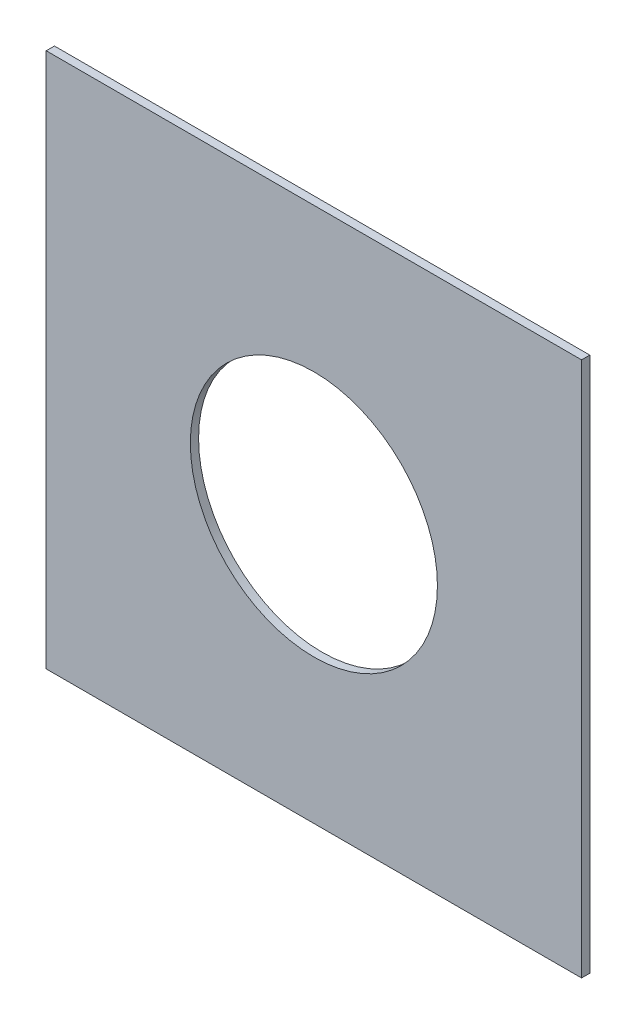
ISO-10303-21;
HEADER;
FILE_DESCRIPTION(('STEP AP214'),'2;1');
FILE_NAME('part.step','',(''),(''),'','','');
FILE_SCHEMA(('AUTOMOTIVE_DESIGN { 1 0 10303 214 1 1 1 1 }'));
ENDSEC;
DATA;
#1=APPLICATION_CONTEXT('core data for automotive mechanical design processes');
#2=APPLICATION_PROTOCOL_DEFINITION('international standard','automotive_design',2000,#1);
#3=PRODUCT_CONTEXT('',#1,'mechanical');
#4=PRODUCT('Part','Part','',(#3));
#5=PRODUCT_RELATED_PRODUCT_CATEGORY('part','',(#4));
#6=PRODUCT_DEFINITION_FORMATION('','',#4);
#7=PRODUCT_DEFINITION_CONTEXT('part definition',#1,'design');
#8=PRODUCT_DEFINITION('design','',#6,#7);
#9=PRODUCT_DEFINITION_SHAPE('','',#8);
#10=(LENGTH_UNIT() NAMED_UNIT(*) SI_UNIT(.MILLI.,.METRE.));
#11=(NAMED_UNIT(*) PLANE_ANGLE_UNIT() SI_UNIT($,.RADIAN.));
#12=(NAMED_UNIT(*) SI_UNIT($,.STERADIAN.) SOLID_ANGLE_UNIT());
#13=UNCERTAINTY_MEASURE_WITH_UNIT(LENGTH_MEASURE(1.E-05),#10,'distance_accuracy_value','');
#14=(GEOMETRIC_REPRESENTATION_CONTEXT(3) GLOBAL_UNCERTAINTY_ASSIGNED_CONTEXT((#13)) GLOBAL_UNIT_ASSIGNED_CONTEXT((#10,
#11,#12)) REPRESENTATION_CONTEXT('',''));
#15=CARTESIAN_POINT('',(0.,0.,0.));
#16=DIRECTION('',(0.,0.,1.));
#17=DIRECTION('',(1.,0.,0.));
#18=AXIS2_PLACEMENT_3D('',#15,#16,#17);
#19=CARTESIAN_POINT('',(0.575,3.549,-6.999));
#20=DIRECTION('',(-1.,0.,0.));
#21=DIRECTION('',(0.,1.,0.));
#22=AXIS2_PLACEMENT_3D('',#19,#20,#21);
#23=PLANE('',#22);
#24=DIRECTION('',(0.,0.,1.));
#25=VECTOR('',#24,1.);
#26=CARTESIAN_POINT('',(0.575,4.85,-7.01));
#27=LINE('',#26,#25);
#28=CARTESIAN_POINT('',(0.575,4.85,-7.02));
#29=VERTEX_POINT('',#28);
#30=CARTESIAN_POINT('',(0.575,4.85,-7.));
#31=VERTEX_POINT('',#30);
#32=EDGE_CURVE('E55',#29,#31,#27,.T.);
#33=ORIENTED_EDGE('',*,*,#32,.F.);
#34=DIRECTION('',(0.,1.,0.));
#35=VECTOR('',#34,1.);
#36=CARTESIAN_POINT('',(0.575,4.2,-7.02));
#37=LINE('',#36,#35);
#38=CARTESIAN_POINT('',(0.575,3.55,-7.02));
#39=VERTEX_POINT('',#38);
#40=EDGE_CURVE('E93',#39,#29,#37,.T.);
#41=ORIENTED_EDGE('',*,*,#40,.F.);
#42=DIRECTION('',(0.,0.,1.));
#43=VECTOR('',#42,1.);
#44=CARTESIAN_POINT('',(0.575,3.55,-7.01));
#45=LINE('',#44,#43);
#46=CARTESIAN_POINT('',(0.575,3.55,-7.));
#47=VERTEX_POINT('',#46);
#48=EDGE_CURVE('E35',#39,#47,#45,.T.);
#49=ORIENTED_EDGE('',*,*,#48,.T.);
#50=DIRECTION('',(0.,-1.,0.));
#51=VECTOR('',#50,1.);
#52=CARTESIAN_POINT('',(0.575,4.2,-7.));
#53=LINE('',#52,#51);
#54=EDGE_CURVE('E76',#31,#47,#53,.T.);
#55=ORIENTED_EDGE('',*,*,#54,.F.);
#56=EDGE_LOOP('',(#33,#41,#49,#55));
#57=FACE_BOUND('',#56,.T.);
#58=ADVANCED_FACE('F17',(#57),#23,.T.);
#59=CARTESIAN_POINT('',(0.574,4.85,-6.999));
#60=DIRECTION('',(0.,1.,0.));
#61=DIRECTION('',(1.,0.,0.));
#62=AXIS2_PLACEMENT_3D('',#59,#60,#61);
#63=PLANE('',#62);
#64=DIRECTION('',(0.,0.,1.));
#65=VECTOR('',#64,1.);
#66=CARTESIAN_POINT('',(1.875,4.85,-7.01));
#67=LINE('',#66,#65);
#68=CARTESIAN_POINT('',(1.875,4.85,-7.02));
#69=VERTEX_POINT('',#68);
#70=CARTESIAN_POINT('',(1.875,4.85,-7.));
#71=VERTEX_POINT('',#70);
#72=EDGE_CURVE('E61',#69,#71,#67,.T.);
#73=ORIENTED_EDGE('',*,*,#72,.F.);
#74=DIRECTION('',(1.,0.,0.));
#75=VECTOR('',#74,1.);
#76=CARTESIAN_POINT('',(1.225,4.85,-7.02));
#77=LINE('',#76,#75);
#78=EDGE_CURVE('E89',#29,#69,#77,.T.);
#79=ORIENTED_EDGE('',*,*,#78,.F.);
#80=ORIENTED_EDGE('',*,*,#32,.T.);
#81=DIRECTION('',(-1.,0.,0.));
#82=VECTOR('',#81,1.);
#83=CARTESIAN_POINT('',(1.225,4.85,-7.));
#84=LINE('',#83,#82);
#85=EDGE_CURVE('E72',#71,#31,#84,.T.);
#86=ORIENTED_EDGE('',*,*,#85,.F.);
#87=EDGE_LOOP('',(#73,#79,#80,#86));
#88=FACE_BOUND('',#87,.T.);
#89=ADVANCED_FACE('F73',(#88),#63,.T.);
#90=CARTESIAN_POINT('',(1.875,4.851,-6.999));
#91=DIRECTION('',(1.,0.,0.));
#92=DIRECTION('',(0.,-1.,0.));
#93=AXIS2_PLACEMENT_3D('',#90,#91,#92);
#94=PLANE('',#93);
#95=DIRECTION('',(0.,0.,-1.));
#96=VECTOR('',#95,1.);
#97=CARTESIAN_POINT('',(1.875,3.55,-7.01));
#98=LINE('',#97,#96);
#99=CARTESIAN_POINT('',(1.875,3.55,-7.));
#100=VERTEX_POINT('',#99);
#101=CARTESIAN_POINT('',(1.875,3.55,-7.02));
#102=VERTEX_POINT('',#101);
#103=EDGE_CURVE('E69',#100,#102,#98,.T.);
#104=ORIENTED_EDGE('',*,*,#103,.T.);
#105=DIRECTION('',(0.,-1.,0.));
#106=VECTOR('',#105,1.);
#107=CARTESIAN_POINT('',(1.875,4.2,-7.02));
#108=LINE('',#107,#106);
#109=EDGE_CURVE('E67',#69,#102,#108,.T.);
#110=ORIENTED_EDGE('',*,*,#109,.F.);
#111=ORIENTED_EDGE('',*,*,#72,.T.);
#112=DIRECTION('',(0.,1.,0.));
#113=VECTOR('',#112,1.);
#114=CARTESIAN_POINT('',(1.875,4.2,-7.));
#115=LINE('',#114,#113);
#116=EDGE_CURVE('E64',#100,#71,#115,.T.);
#117=ORIENTED_EDGE('',*,*,#116,.F.);
#118=EDGE_LOOP('',(#104,#110,#111,#117));
#119=FACE_BOUND('',#118,.T.);
#120=ADVANCED_FACE('F62',(#119),#94,.T.);
#121=CARTESIAN_POINT('',(1.225,4.2,-7.));
#122=DIRECTION('',(0.,0.,-1.));
#123=DIRECTION('',(-1.,0.,0.));
#124=AXIS2_PLACEMENT_3D('',#121,#122,#123);
#125=CYLINDRICAL_SURFACE('',#124,0.300000000000001);
#126=CARTESIAN_POINT('',(1.225,4.2,-7.02));
#127=DIRECTION('',(0.,0.,-1.));
#128=DIRECTION('',(-1.,0.,0.));
#129=AXIS2_PLACEMENT_3D('',#126,#127,#128);
#130=CIRCLE('',#129,0.300000000000001);
#131=CARTESIAN_POINT('',(0.924999999999999,4.2,-7.02));
#132=VERTEX_POINT('',#131);
#133=EDGE_CURVE('E84',#132,#132,#130,.F.);
#134=ORIENTED_EDGE('',*,*,#133,.F.);
#135=EDGE_LOOP('',(#134));
#136=FACE_BOUND('',#135,.T.);
#137=CARTESIAN_POINT('',(1.225,4.2,-7.));
#138=DIRECTION('',(0.,0.,-1.));
#139=DIRECTION('',(-1.,0.,0.));
#140=AXIS2_PLACEMENT_3D('',#137,#138,#139);
#141=CIRCLE('',#140,0.300000000000001);
#142=CARTESIAN_POINT('',(0.924999999999999,4.2,-7.));
#143=VERTEX_POINT('',#142);
#144=EDGE_CURVE('E21',#143,#143,#141,.T.);
#145=ORIENTED_EDGE('',*,*,#144,.F.);
#146=EDGE_LOOP('',(#145));
#147=FACE_BOUND('',#146,.T.);
#148=ADVANCED_FACE('F101',(#136,#147),#125,.F.);
#149=CARTESIAN_POINT('',(1.876,4.851,-7.));
#150=DIRECTION('',(0.,0.,1.));
#151=DIRECTION('',(-1.,0.,0.));
#152=AXIS2_PLACEMENT_3D('',#149,#150,#151);
#153=PLANE('',#152);
#154=ORIENTED_EDGE('',*,*,#144,.T.);
#155=EDGE_LOOP('',(#154));
#156=FACE_BOUND('',#155,.T.);
#157=ORIENTED_EDGE('',*,*,#54,.T.);
#158=DIRECTION('',(-1.,0.,0.));
#159=VECTOR('',#158,1.);
#160=CARTESIAN_POINT('',(1.225,3.55,-7.));
#161=LINE('',#160,#159);
#162=EDGE_CURVE('E27',#100,#47,#161,.T.);
#163=ORIENTED_EDGE('',*,*,#162,.F.);
#164=ORIENTED_EDGE('',*,*,#116,.T.);
#165=ORIENTED_EDGE('',*,*,#85,.T.);
#166=EDGE_LOOP('',(#157,#163,#164,#165));
#167=FACE_BOUND('',#166,.T.);
#168=ADVANCED_FACE('F78',(#156,#167),#153,.T.);
#169=CARTESIAN_POINT('',(0.574,4.851,-7.02));
#170=DIRECTION('',(0.,0.,-1.));
#171=DIRECTION('',(1.,0.,0.));
#172=AXIS2_PLACEMENT_3D('',#169,#170,#171);
#173=PLANE('',#172);
#174=ORIENTED_EDGE('',*,*,#133,.T.);
#175=EDGE_LOOP('',(#174));
#176=FACE_BOUND('',#175,.T.);
#177=ORIENTED_EDGE('',*,*,#78,.T.);
#178=ORIENTED_EDGE('',*,*,#109,.T.);
#179=DIRECTION('',(1.,0.,0.));
#180=VECTOR('',#179,1.);
#181=CARTESIAN_POINT('',(1.225,3.55,-7.02));
#182=LINE('',#181,#180);
#183=EDGE_CURVE('E11',#39,#102,#182,.T.);
#184=ORIENTED_EDGE('',*,*,#183,.F.);
#185=ORIENTED_EDGE('',*,*,#40,.T.);
#186=EDGE_LOOP('',(#177,#178,#184,#185));
#187=FACE_BOUND('',#186,.T.);
#188=ADVANCED_FACE('F110',(#176,#187),#173,.T.);
#189=CARTESIAN_POINT('',(1.876,3.55,-6.999));
#190=DIRECTION('',(0.,-1.,0.));
#191=DIRECTION('',(-1.,0.,0.));
#192=AXIS2_PLACEMENT_3D('',#189,#190,#191);
#193=PLANE('',#192);
#194=ORIENTED_EDGE('',*,*,#48,.F.);
#195=ORIENTED_EDGE('',*,*,#183,.T.);
#196=ORIENTED_EDGE('',*,*,#103,.F.);
#197=ORIENTED_EDGE('',*,*,#162,.T.);
#198=EDGE_LOOP('',(#194,#195,#196,#197));
#199=FACE_BOUND('',#198,.T.);
#200=ADVANCED_FACE('F19',(#199),#193,.T.);
#201=CLOSED_SHELL('',(#58,#89,#120,#148,#168,#188,#200));
#202=MANIFOLD_SOLID_BREP('B1',#201);
#203=ADVANCED_BREP_SHAPE_REPRESENTATION('',(#18,#202),#14);
#204=SHAPE_DEFINITION_REPRESENTATION(#9,#203);
ENDSEC;
END-ISO-10303-21;
